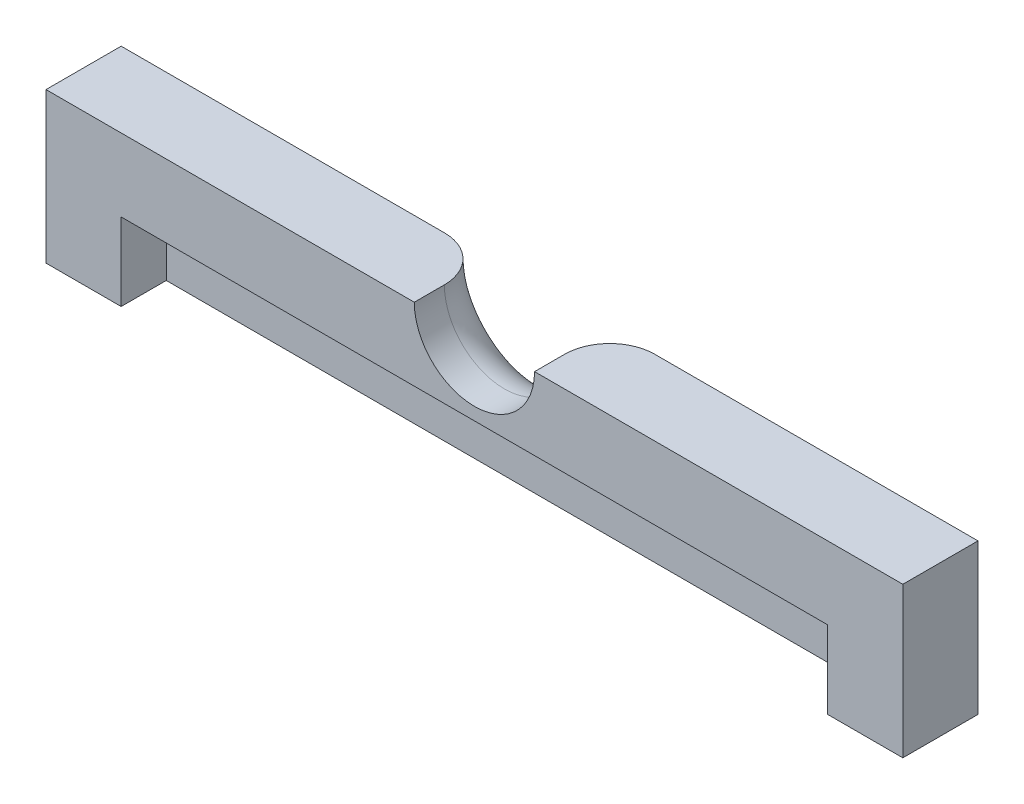
ISO-10303-21;
HEADER;
FILE_DESCRIPTION(('STEP AP214'),'2;1');
FILE_NAME('part.step','',(''),(''),'','','');
FILE_SCHEMA(('AUTOMOTIVE_DESIGN { 1 0 10303 214 1 1 1 1 }'));
ENDSEC;
DATA;
#1=APPLICATION_CONTEXT('core data for automotive mechanical design processes');
#2=APPLICATION_PROTOCOL_DEFINITION('international standard','automotive_design',2000,#1);
#3=PRODUCT_CONTEXT('',#1,'mechanical');
#4=PRODUCT('Part','Part','',(#3));
#5=PRODUCT_RELATED_PRODUCT_CATEGORY('part','',(#4));
#6=PRODUCT_DEFINITION_FORMATION('','',#4);
#7=PRODUCT_DEFINITION_CONTEXT('part definition',#1,'design');
#8=PRODUCT_DEFINITION('design','',#6,#7);
#9=PRODUCT_DEFINITION_SHAPE('','',#8);
#10=(LENGTH_UNIT() NAMED_UNIT(*) SI_UNIT(.MILLI.,.METRE.));
#11=(NAMED_UNIT(*) PLANE_ANGLE_UNIT() SI_UNIT($,.RADIAN.));
#12=(NAMED_UNIT(*) SI_UNIT($,.STERADIAN.) SOLID_ANGLE_UNIT());
#13=UNCERTAINTY_MEASURE_WITH_UNIT(LENGTH_MEASURE(1.E-05),#10,'distance_accuracy_value','');
#14=(GEOMETRIC_REPRESENTATION_CONTEXT(3) GLOBAL_UNCERTAINTY_ASSIGNED_CONTEXT((#13)) GLOBAL_UNIT_ASSIGNED_CONTEXT((#10,
#11,#12)) REPRESENTATION_CONTEXT('',''));
#15=CARTESIAN_POINT('',(0.,0.,0.));
#16=DIRECTION('',(0.,0.,1.));
#17=DIRECTION('',(1.,0.,0.));
#18=AXIS2_PLACEMENT_3D('',#15,#16,#17);
#19=CARTESIAN_POINT('',(0.,0.,5.));
#20=DIRECTION('',(0.,-1.,0.));
#21=DIRECTION('',(0.,0.,-1.));
#22=AXIS2_PLACEMENT_3D('',#19,#20,#21);
#23=PLANE('',#22);
#24=DIRECTION('',(0.,0.,-1.));
#25=VECTOR('',#24,1.);
#26=CARTESIAN_POINT('',(24.5,0.,5.));
#27=LINE('',#26,#25);
#28=CARTESIAN_POINT('',(24.5,0.,5.));
#29=VERTEX_POINT('',#28);
#30=CARTESIAN_POINT('',(24.5,0.,3.));
#31=VERTEX_POINT('',#30);
#32=EDGE_CURVE('E114',#29,#31,#27,.T.);
#33=ORIENTED_EDGE('',*,*,#32,.T.);
#34=CARTESIAN_POINT('',(21.5,0.,3.));
#35=DIRECTION('',(0.,-1.,0.));
#36=DIRECTION('',(0.,0.,-1.));
#37=AXIS2_PLACEMENT_3D('',#34,#35,#36);
#38=CIRCLE('',#37,3.);
#39=CARTESIAN_POINT('',(21.5,0.,0.));
#40=VERTEX_POINT('',#39);
#41=EDGE_CURVE('E55',#31,#40,#38,.F.);
#42=ORIENTED_EDGE('',*,*,#41,.T.);
#43=DIRECTION('',(-1.,0.,0.));
#44=VECTOR('',#43,1.);
#45=CARTESIAN_POINT('',(0.,0.,0.));
#46=LINE('',#45,#44);
#47=CARTESIAN_POINT('',(0.,0.,0.));
#48=VERTEX_POINT('',#47);
#49=EDGE_CURVE('E151',#40,#48,#46,.T.);
#50=ORIENTED_EDGE('',*,*,#49,.T.);
#51=DIRECTION('',(0.,0.,-1.));
#52=VECTOR('',#51,1.);
#53=CARTESIAN_POINT('',(0.,0.,5.));
#54=LINE('',#53,#52);
#55=CARTESIAN_POINT('',(0.,0.,5.));
#56=VERTEX_POINT('',#55);
#57=EDGE_CURVE('E135',#56,#48,#54,.T.);
#58=ORIENTED_EDGE('',*,*,#57,.F.);
#59=DIRECTION('',(-1.,0.,0.));
#60=VECTOR('',#59,1.);
#61=CARTESIAN_POINT('',(0.,0.,5.));
#62=LINE('',#61,#60);
#63=EDGE_CURVE('E129',#29,#56,#62,.T.);
#64=ORIENTED_EDGE('',*,*,#63,.F.);
#65=EDGE_LOOP('',(#33,#42,#50,#58,#64));
#66=FACE_BOUND('',#65,.T.);
#67=ADVANCED_FACE('F33',(#66),#23,.F.);
#68=CARTESIAN_POINT('',(0.,0.,5.));
#69=DIRECTION('',(1.,0.,0.));
#70=DIRECTION('',(0.,1.,0.));
#71=AXIS2_PLACEMENT_3D('',#68,#69,#70);
#72=PLANE('',#71);
#73=DIRECTION('',(0.,-1.,0.));
#74=VECTOR('',#73,1.);
#75=CARTESIAN_POINT('',(0.,0.,0.));
#76=LINE('',#75,#74);
#77=CARTESIAN_POINT('',(0.,-10.,0.));
#78=VERTEX_POINT('',#77);
#79=EDGE_CURVE('E143',#48,#78,#76,.T.);
#80=ORIENTED_EDGE('',*,*,#79,.T.);
#81=DIRECTION('',(0.,0.,-1.));
#82=VECTOR('',#81,1.);
#83=CARTESIAN_POINT('',(0.,-10.,5.));
#84=LINE('',#83,#82);
#85=CARTESIAN_POINT('',(0.,-10.,5.));
#86=VERTEX_POINT('',#85);
#87=EDGE_CURVE('E162',#86,#78,#84,.T.);
#88=ORIENTED_EDGE('',*,*,#87,.F.);
#89=DIRECTION('',(0.,-1.,0.));
#90=VECTOR('',#89,1.);
#91=CARTESIAN_POINT('',(0.,0.,5.));
#92=LINE('',#91,#90);
#93=EDGE_CURVE('E154',#56,#86,#92,.T.);
#94=ORIENTED_EDGE('',*,*,#93,.F.);
#95=ORIENTED_EDGE('',*,*,#57,.T.);
#96=EDGE_LOOP('',(#80,#88,#94,#95));
#97=FACE_BOUND('',#96,.T.);
#98=ADVANCED_FACE('F175',(#97),#72,.F.);
#99=CARTESIAN_POINT('',(0.,-10.,5.));
#100=DIRECTION('',(0.,1.,0.));
#101=DIRECTION('',(0.,0.,1.));
#102=AXIS2_PLACEMENT_3D('',#99,#100,#101);
#103=PLANE('',#102);
#104=DIRECTION('',(1.,0.,0.));
#105=VECTOR('',#104,1.);
#106=CARTESIAN_POINT('',(5.00000000000001,-10.,2.));
#107=LINE('',#106,#105);
#108=CARTESIAN_POINT('',(5.00000000000001,-10.,2.));
#109=VERTEX_POINT('',#108);
#110=CARTESIAN_POINT('',(52.,-10.,2.));
#111=VERTEX_POINT('',#110);
#112=EDGE_CURVE('E193',#109,#111,#107,.T.);
#113=ORIENTED_EDGE('',*,*,#112,.F.);
#114=DIRECTION('',(0.,0.,1.));
#115=VECTOR('',#114,1.);
#116=CARTESIAN_POINT('',(5.00000000000001,-10.,2.));
#117=LINE('',#116,#115);
#118=CARTESIAN_POINT('',(5.00000000000001,-10.,5.));
#119=VERTEX_POINT('',#118);
#120=EDGE_CURVE('E202',#109,#119,#117,.T.);
#121=ORIENTED_EDGE('',*,*,#120,.T.);
#122=DIRECTION('',(1.,0.,0.));
#123=VECTOR('',#122,1.);
#124=CARTESIAN_POINT('',(0.,-10.,5.));
#125=LINE('',#124,#123);
#126=EDGE_CURVE('E139',#86,#119,#125,.T.);
#127=ORIENTED_EDGE('',*,*,#126,.F.);
#128=ORIENTED_EDGE('',*,*,#87,.T.);
#129=DIRECTION('',(1.,0.,0.));
#130=VECTOR('',#129,1.);
#131=CARTESIAN_POINT('',(0.,-10.,0.));
#132=LINE('',#131,#130);
#133=CARTESIAN_POINT('',(57.,-10.,0.));
#134=VERTEX_POINT('',#133);
#135=EDGE_CURVE('E146',#78,#134,#132,.T.);
#136=ORIENTED_EDGE('',*,*,#135,.T.);
#137=DIRECTION('',(0.,0.,-1.));
#138=VECTOR('',#137,1.);
#139=CARTESIAN_POINT('',(57.,-10.,5.));
#140=LINE('',#139,#138);
#141=CARTESIAN_POINT('',(57.,-10.,5.));
#142=VERTEX_POINT('',#141);
#143=EDGE_CURVE('E159',#142,#134,#140,.T.);
#144=ORIENTED_EDGE('',*,*,#143,.F.);
#145=CARTESIAN_POINT('',(52.,-10.,5.));
#146=VERTEX_POINT('',#145);
#147=EDGE_CURVE('E214',#146,#142,#125,.T.);
#148=ORIENTED_EDGE('',*,*,#147,.F.);
#149=DIRECTION('',(0.,0.,1.));
#150=VECTOR('',#149,1.);
#151=CARTESIAN_POINT('',(52.,-10.,2.));
#152=LINE('',#151,#150);
#153=EDGE_CURVE('E211',#111,#146,#152,.T.);
#154=ORIENTED_EDGE('',*,*,#153,.F.);
#155=EDGE_LOOP('',(#113,#121,#127,#128,#136,#144,#148,#154));
#156=FACE_BOUND('',#155,.T.);
#157=ADVANCED_FACE('F169',(#156),#103,.F.);
#158=CARTESIAN_POINT('',(57.,0.,5.));
#159=DIRECTION('',(-1.,0.,0.));
#160=DIRECTION('',(0.,0.,1.));
#161=AXIS2_PLACEMENT_3D('',#158,#159,#160);
#162=PLANE('',#161);
#163=DIRECTION('',(0.,1.,0.));
#164=VECTOR('',#163,1.);
#165=CARTESIAN_POINT('',(57.,0.,0.));
#166=LINE('',#165,#164);
#167=CARTESIAN_POINT('',(57.,0.,0.));
#168=VERTEX_POINT('',#167);
#169=EDGE_CURVE('E149',#134,#168,#166,.T.);
#170=ORIENTED_EDGE('',*,*,#169,.T.);
#171=DIRECTION('',(0.,0.,-1.));
#172=VECTOR('',#171,1.);
#173=CARTESIAN_POINT('',(57.,0.,5.));
#174=LINE('',#173,#172);
#175=CARTESIAN_POINT('',(57.,0.,5.));
#176=VERTEX_POINT('',#175);
#177=EDGE_CURVE('E156',#176,#168,#174,.T.);
#178=ORIENTED_EDGE('',*,*,#177,.F.);
#179=DIRECTION('',(0.,1.,0.));
#180=VECTOR('',#179,1.);
#181=CARTESIAN_POINT('',(57.,0.,5.));
#182=LINE('',#181,#180);
#183=EDGE_CURVE('E137',#142,#176,#182,.T.);
#184=ORIENTED_EDGE('',*,*,#183,.F.);
#185=ORIENTED_EDGE('',*,*,#143,.T.);
#186=EDGE_LOOP('',(#170,#178,#184,#185));
#187=FACE_BOUND('',#186,.T.);
#188=ADVANCED_FACE('F180',(#187),#162,.F.);
#189=CARTESIAN_POINT('',(35.5,0.,0.));
#190=VERTEX_POINT('',#189);
#191=EDGE_CURVE('E152',#168,#190,#46,.T.);
#192=ORIENTED_EDGE('',*,*,#191,.T.);
#193=CARTESIAN_POINT('',(35.5,0.,3.));
#194=DIRECTION('',(0.,-1.,0.));
#195=DIRECTION('',(0.,0.,-1.));
#196=AXIS2_PLACEMENT_3D('',#193,#194,#195);
#197=CIRCLE('',#196,3.);
#198=CARTESIAN_POINT('',(32.5,0.,3.));
#199=VERTEX_POINT('',#198);
#200=EDGE_CURVE('E11',#190,#199,#197,.F.);
#201=ORIENTED_EDGE('',*,*,#200,.T.);
#202=DIRECTION('',(0.,0.,-1.));
#203=VECTOR('',#202,1.);
#204=CARTESIAN_POINT('',(32.5,0.,5.));
#205=LINE('',#204,#203);
#206=CARTESIAN_POINT('',(32.5,0.,5.));
#207=VERTEX_POINT('',#206);
#208=EDGE_CURVE('E123',#207,#199,#205,.T.);
#209=ORIENTED_EDGE('',*,*,#208,.F.);
#210=EDGE_CURVE('E132',#176,#207,#62,.T.);
#211=ORIENTED_EDGE('',*,*,#210,.F.);
#212=ORIENTED_EDGE('',*,*,#177,.T.);
#213=EDGE_LOOP('',(#192,#201,#209,#211,#212));
#214=FACE_BOUND('',#213,.T.);
#215=ADVANCED_FACE('F183',(#214),#23,.F.);
#216=CARTESIAN_POINT('',(0.,0.,5.));
#217=DIRECTION('',(0.,0.,1.));
#218=DIRECTION('',(1.,0.,0.));
#219=AXIS2_PLACEMENT_3D('',#216,#217,#218);
#220=PLANE('',#219);
#221=CARTESIAN_POINT('',(28.5,0.,5.));
#222=DIRECTION('',(0.,0.,-1.));
#223=DIRECTION('',(-1.,0.,0.));
#224=AXIS2_PLACEMENT_3D('',#221,#222,#223);
#225=CIRCLE('',#224,4.);
#226=EDGE_CURVE('E118',#207,#29,#225,.T.);
#227=ORIENTED_EDGE('',*,*,#226,.T.);
#228=ORIENTED_EDGE('',*,*,#63,.T.);
#229=ORIENTED_EDGE('',*,*,#93,.T.);
#230=ORIENTED_EDGE('',*,*,#126,.T.);
#231=DIRECTION('',(0.,-1.,0.));
#232=VECTOR('',#231,1.);
#233=CARTESIAN_POINT('',(5.00000000000001,-10.,5.));
#234=LINE('',#233,#232);
#235=CARTESIAN_POINT('',(5.00000000000001,-4.83768035483387,5.));
#236=VERTEX_POINT('',#235);
#237=EDGE_CURVE('E185',#236,#119,#234,.T.);
#238=ORIENTED_EDGE('',*,*,#237,.F.);
#239=DIRECTION('',(-1.,0.,0.));
#240=VECTOR('',#239,1.);
#241=CARTESIAN_POINT('',(5.00000000000001,-4.83768035483387,5.));
#242=LINE('',#241,#240);
#243=CARTESIAN_POINT('',(52.,-4.83768035483387,5.));
#244=VERTEX_POINT('',#243);
#245=EDGE_CURVE('E194',#244,#236,#242,.T.);
#246=ORIENTED_EDGE('',*,*,#245,.F.);
#247=DIRECTION('',(0.,1.,0.));
#248=VECTOR('',#247,1.);
#249=CARTESIAN_POINT('',(52.,-10.,5.));
#250=LINE('',#249,#248);
#251=EDGE_CURVE('E187',#146,#244,#250,.T.);
#252=ORIENTED_EDGE('',*,*,#251,.F.);
#253=ORIENTED_EDGE('',*,*,#147,.T.);
#254=ORIENTED_EDGE('',*,*,#183,.T.);
#255=ORIENTED_EDGE('',*,*,#210,.T.);
#256=EDGE_LOOP('',(#227,#228,#229,#230,#238,#246,#252,#253,#254,#255));
#257=FACE_BOUND('',#256,.T.);
#258=ADVANCED_FACE('F127',(#257),#220,.T.);
#259=CARTESIAN_POINT('',(0.,0.,0.));
#260=DIRECTION('',(0.,0.,1.));
#261=DIRECTION('',(1.,0.,0.));
#262=AXIS2_PLACEMENT_3D('',#259,#260,#261);
#263=PLANE('',#262);
#264=ORIENTED_EDGE('',*,*,#49,.F.);
#265=CARTESIAN_POINT('',(28.5,0.,0.));
#266=DIRECTION('',(0.,0.,1.));
#267=DIRECTION('',(1.,0.,0.));
#268=AXIS2_PLACEMENT_3D('',#265,#266,#267);
#269=CIRCLE('',#268,7.);
#270=EDGE_CURVE('E41',#40,#190,#269,.T.);
#271=ORIENTED_EDGE('',*,*,#270,.T.);
#272=ORIENTED_EDGE('',*,*,#191,.F.);
#273=ORIENTED_EDGE('',*,*,#169,.F.);
#274=ORIENTED_EDGE('',*,*,#135,.F.);
#275=ORIENTED_EDGE('',*,*,#79,.F.);
#276=EDGE_LOOP('',(#264,#271,#272,#273,#274,#275));
#277=FACE_BOUND('',#276,.T.);
#278=ADVANCED_FACE('F176',(#277),#263,.F.);
#279=CARTESIAN_POINT('',(5.00000000000001,-10.,2.));
#280=DIRECTION('',(-1.,0.,0.));
#281=DIRECTION('',(0.,0.,1.));
#282=AXIS2_PLACEMENT_3D('',#279,#280,#281);
#283=PLANE('',#282);
#284=ORIENTED_EDGE('',*,*,#237,.T.);
#285=ORIENTED_EDGE('',*,*,#120,.F.);
#286=DIRECTION('',(0.,-1.,0.));
#287=VECTOR('',#286,1.);
#288=CARTESIAN_POINT('',(5.00000000000001,-10.,2.));
#289=LINE('',#288,#287);
#290=CARTESIAN_POINT('',(5.00000000000001,-4.83768035483387,2.));
#291=VERTEX_POINT('',#290);
#292=EDGE_CURVE('E190',#291,#109,#289,.T.);
#293=ORIENTED_EDGE('',*,*,#292,.F.);
#294=DIRECTION('',(0.,0.,1.));
#295=VECTOR('',#294,1.);
#296=CARTESIAN_POINT('',(5.00000000000001,-4.83768035483387,2.));
#297=LINE('',#296,#295);
#298=EDGE_CURVE('E147',#291,#236,#297,.T.);
#299=ORIENTED_EDGE('',*,*,#298,.T.);
#300=EDGE_LOOP('',(#284,#285,#293,#299));
#301=FACE_BOUND('',#300,.T.);
#302=ADVANCED_FACE('F227',(#301),#283,.F.);
#303=CARTESIAN_POINT('',(5.00000000000001,-4.83768035483387,2.));
#304=DIRECTION('',(0.,1.,0.));
#305=DIRECTION('',(0.,0.,1.));
#306=AXIS2_PLACEMENT_3D('',#303,#304,#305);
#307=PLANE('',#306);
#308=ORIENTED_EDGE('',*,*,#245,.T.);
#309=ORIENTED_EDGE('',*,*,#298,.F.);
#310=DIRECTION('',(-1.,0.,0.));
#311=VECTOR('',#310,1.);
#312=CARTESIAN_POINT('',(5.00000000000001,-4.83768035483387,2.));
#313=LINE('',#312,#311);
#314=CARTESIAN_POINT('',(52.,-4.83768035483387,2.));
#315=VERTEX_POINT('',#314);
#316=EDGE_CURVE('E200',#315,#291,#313,.T.);
#317=ORIENTED_EDGE('',*,*,#316,.F.);
#318=DIRECTION('',(0.,0.,1.));
#319=VECTOR('',#318,1.);
#320=CARTESIAN_POINT('',(52.,-4.83768035483387,2.));
#321=LINE('',#320,#319);
#322=EDGE_CURVE('E209',#315,#244,#321,.T.);
#323=ORIENTED_EDGE('',*,*,#322,.T.);
#324=EDGE_LOOP('',(#308,#309,#317,#323));
#325=FACE_BOUND('',#324,.T.);
#326=ADVANCED_FACE('F229',(#325),#307,.F.);
#327=CARTESIAN_POINT('',(52.,-10.,2.));
#328=DIRECTION('',(1.,0.,0.));
#329=DIRECTION('',(0.,0.,-1.));
#330=AXIS2_PLACEMENT_3D('',#327,#328,#329);
#331=PLANE('',#330);
#332=ORIENTED_EDGE('',*,*,#251,.T.);
#333=ORIENTED_EDGE('',*,*,#322,.F.);
#334=DIRECTION('',(0.,1.,0.));
#335=VECTOR('',#334,1.);
#336=CARTESIAN_POINT('',(52.,-10.,2.));
#337=LINE('',#336,#335);
#338=EDGE_CURVE('E197',#111,#315,#337,.T.);
#339=ORIENTED_EDGE('',*,*,#338,.F.);
#340=ORIENTED_EDGE('',*,*,#153,.T.);
#341=EDGE_LOOP('',(#332,#333,#339,#340));
#342=FACE_BOUND('',#341,.T.);
#343=ADVANCED_FACE('F221',(#342),#331,.F.);
#344=CARTESIAN_POINT('',(0.,0.,2.));
#345=DIRECTION('',(0.,0.,-1.));
#346=DIRECTION('',(-1.,0.,0.));
#347=AXIS2_PLACEMENT_3D('',#344,#345,#346);
#348=PLANE('',#347);
#349=ORIENTED_EDGE('',*,*,#292,.T.);
#350=ORIENTED_EDGE('',*,*,#112,.T.);
#351=ORIENTED_EDGE('',*,*,#338,.T.);
#352=ORIENTED_EDGE('',*,*,#316,.T.);
#353=EDGE_LOOP('',(#349,#350,#351,#352));
#354=FACE_BOUND('',#353,.T.);
#355=ADVANCED_FACE('F224',(#354),#348,.F.);
#356=CARTESIAN_POINT('',(28.5,0.,5.));
#357=DIRECTION('',(0.,0.,-1.));
#358=DIRECTION('',(-1.,0.,0.));
#359=AXIS2_PLACEMENT_3D('',#356,#357,#358);
#360=CYLINDRICAL_SURFACE('',#359,4.);
#361=ORIENTED_EDGE('',*,*,#208,.T.);
#362=CARTESIAN_POINT('',(28.5,0.,3.));
#363=DIRECTION('',(0.,0.,1.));
#364=DIRECTION('',(1.,0.,0.));
#365=AXIS2_PLACEMENT_3D('',#362,#363,#364);
#366=CIRCLE('',#365,4.);
#367=EDGE_CURVE('E121',#199,#31,#366,.F.);
#368=ORIENTED_EDGE('',*,*,#367,.T.);
#369=ORIENTED_EDGE('',*,*,#32,.F.);
#370=ORIENTED_EDGE('',*,*,#226,.F.);
#371=EDGE_LOOP('',(#361,#368,#369,#370));
#372=FACE_BOUND('',#371,.T.);
#373=ADVANCED_FACE('F117',(#372),#360,.F.);
#374=CARTESIAN_POINT('',(28.5,0.,3.));
#375=DIRECTION('',(0.,0.,1.));
#376=DIRECTION('',(1.,0.,0.));
#377=AXIS2_PLACEMENT_3D('',#374,#375,#376);
#378=TOROIDAL_SURFACE('',#377,7.,3.);
#379=ORIENTED_EDGE('',*,*,#200,.F.);
#380=ORIENTED_EDGE('',*,*,#270,.F.);
#381=ORIENTED_EDGE('',*,*,#41,.F.);
#382=ORIENTED_EDGE('',*,*,#367,.F.);
#383=EDGE_LOOP('',(#379,#380,#381,#382));
#384=FACE_BOUND('',#383,.T.);
#385=ADVANCED_FACE('F35',(#384),#378,.T.);
#386=CLOSED_SHELL('',(#67,#98,#157,#188,#215,#258,#278,#302,#326,#343,#355,#373,#385));
#387=MANIFOLD_SOLID_BREP('B2',#386);
#388=ADVANCED_BREP_SHAPE_REPRESENTATION('',(#18,#387),#14);
#389=SHAPE_DEFINITION_REPRESENTATION(#9,#388);
ENDSEC;
END-ISO-10303-21;
